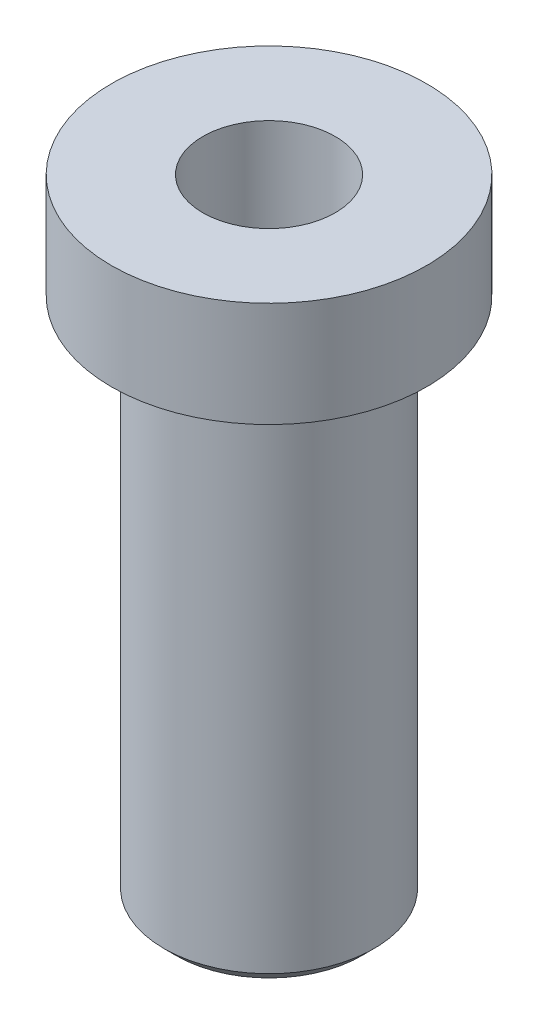
ISO-10303-21;
HEADER;
FILE_DESCRIPTION(('STEP AP214'),'2;1');
FILE_NAME('part.step','',(''),(''),'','','');
FILE_SCHEMA(('AUTOMOTIVE_DESIGN { 1 0 10303 214 1 1 1 1 }'));
ENDSEC;
DATA;
#1=APPLICATION_CONTEXT('core data for automotive mechanical design processes');
#2=APPLICATION_PROTOCOL_DEFINITION('international standard','automotive_design',2000,#1);
#3=PRODUCT_CONTEXT('',#1,'mechanical');
#4=PRODUCT('Part','Part','',(#3));
#5=PRODUCT_RELATED_PRODUCT_CATEGORY('part','',(#4));
#6=PRODUCT_DEFINITION_FORMATION('','',#4);
#7=PRODUCT_DEFINITION_CONTEXT('part definition',#1,'design');
#8=PRODUCT_DEFINITION('design','',#6,#7);
#9=PRODUCT_DEFINITION_SHAPE('','',#8);
#10=(LENGTH_UNIT() NAMED_UNIT(*) SI_UNIT(.MILLI.,.METRE.));
#11=(NAMED_UNIT(*) PLANE_ANGLE_UNIT() SI_UNIT($,.RADIAN.));
#12=(NAMED_UNIT(*) SI_UNIT($,.STERADIAN.) SOLID_ANGLE_UNIT());
#13=UNCERTAINTY_MEASURE_WITH_UNIT(LENGTH_MEASURE(1.E-05),#10,'distance_accuracy_value','');
#14=(GEOMETRIC_REPRESENTATION_CONTEXT(3) GLOBAL_UNCERTAINTY_ASSIGNED_CONTEXT((#13)) GLOBAL_UNIT_ASSIGNED_CONTEXT((#10,
#11,#12)) REPRESENTATION_CONTEXT('',''));
#15=CARTESIAN_POINT('',(0.,0.,0.));
#16=DIRECTION('',(0.,0.,1.));
#17=DIRECTION('',(1.,0.,0.));
#18=AXIS2_PLACEMENT_3D('',#15,#16,#17);
#19=CARTESIAN_POINT('',(0.,3.,0.));
#20=DIRECTION('',(0.,-1.,0.));
#21=DIRECTION('',(0.,0.,-1.));
#22=AXIS2_PLACEMENT_3D('',#19,#20,#21);
#23=CYLINDRICAL_SURFACE('',#22,0.5);
#24=CARTESIAN_POINT('',(0.,0.0600000000000006,0.));
#25=DIRECTION('',(0.,1.,0.));
#26=DIRECTION('',(0.,0.,1.));
#27=AXIS2_PLACEMENT_3D('',#24,#25,#26);
#28=CIRCLE('',#27,0.5);
#29=CARTESIAN_POINT('',(0.,0.0600000000000006,0.5));
#30=VERTEX_POINT('',#29);
#31=EDGE_CURVE('E45',#30,#30,#28,.T.);
#32=ORIENTED_EDGE('',*,*,#31,.T.);
#33=EDGE_LOOP('',(#32));
#34=FACE_BOUND('',#33,.T.);
#35=CARTESIAN_POINT('',(0.,2.5,0.));
#36=DIRECTION('',(0.,1.,0.));
#37=DIRECTION('',(0.,0.,1.));
#38=AXIS2_PLACEMENT_3D('',#35,#36,#37);
#39=CIRCLE('',#38,0.5);
#40=CARTESIAN_POINT('',(0.,2.5,0.5));
#41=VERTEX_POINT('',#40);
#42=EDGE_CURVE('E49',#41,#41,#39,.T.);
#43=ORIENTED_EDGE('',*,*,#42,.F.);
#44=EDGE_LOOP('',(#43));
#45=FACE_BOUND('',#44,.T.);
#46=ADVANCED_FACE('F37',(#34,#45),#23,.T.);
#47=CARTESIAN_POINT('',(0.,0.,0.));
#48=DIRECTION('',(0.,1.,0.));
#49=DIRECTION('',(0.,0.,1.));
#50=AXIS2_PLACEMENT_3D('',#47,#48,#49);
#51=PLANE('',#50);
#52=CARTESIAN_POINT('',(0.,0.,0.));
#53=DIRECTION('',(0.,1.,0.));
#54=DIRECTION('',(0.,0.,1.));
#55=AXIS2_PLACEMENT_3D('',#52,#53,#54);
#56=CIRCLE('',#55,0.315);
#57=CARTESIAN_POINT('',(0.,0.,0.315));
#58=VERTEX_POINT('',#57);
#59=EDGE_CURVE('E59',#58,#58,#56,.T.);
#60=ORIENTED_EDGE('',*,*,#59,.T.);
#61=EDGE_LOOP('',(#60));
#62=FACE_BOUND('',#61,.T.);
#63=CARTESIAN_POINT('',(0.,0.,0.));
#64=DIRECTION('',(0.,1.,0.));
#65=DIRECTION('',(0.,0.,1.));
#66=AXIS2_PLACEMENT_3D('',#63,#64,#65);
#67=CIRCLE('',#66,0.439999999999999);
#68=CARTESIAN_POINT('',(0.,0.,0.439999999999999));
#69=VERTEX_POINT('',#68);
#70=EDGE_CURVE('E10',#69,#69,#67,.F.);
#71=ORIENTED_EDGE('',*,*,#70,.T.);
#72=EDGE_LOOP('',(#71));
#73=FACE_BOUND('',#72,.T.);
#74=ADVANCED_FACE('F68',(#62,#73),#51,.F.);
#75=CARTESIAN_POINT('',(0.,2.5,0.));
#76=DIRECTION('',(0.,1.,0.));
#77=DIRECTION('',(0.,0.,1.));
#78=AXIS2_PLACEMENT_3D('',#75,#76,#77);
#79=CYLINDRICAL_SURFACE('',#78,0.75);
#80=CARTESIAN_POINT('',(0.,2.5,0.));
#81=DIRECTION('',(0.,1.,0.));
#82=DIRECTION('',(0.,0.,1.));
#83=AXIS2_PLACEMENT_3D('',#80,#81,#82);
#84=CIRCLE('',#83,0.75);
#85=CARTESIAN_POINT('',(0.,2.5,0.75));
#86=VERTEX_POINT('',#85);
#87=EDGE_CURVE('E53',#86,#86,#84,.T.);
#88=ORIENTED_EDGE('',*,*,#87,.T.);
#89=EDGE_LOOP('',(#88));
#90=FACE_BOUND('',#89,.T.);
#91=CARTESIAN_POINT('',(0.,3.,0.));
#92=DIRECTION('',(0.,1.,0.));
#93=DIRECTION('',(0.,0.,1.));
#94=AXIS2_PLACEMENT_3D('',#91,#92,#93);
#95=CIRCLE('',#94,0.75);
#96=CARTESIAN_POINT('',(0.,3.,0.75));
#97=VERTEX_POINT('',#96);
#98=EDGE_CURVE('E56',#97,#97,#95,.T.);
#99=ORIENTED_EDGE('',*,*,#98,.F.);
#100=EDGE_LOOP('',(#99));
#101=FACE_BOUND('',#100,.T.);
#102=ADVANCED_FACE('F83',(#90,#101),#79,.T.);
#103=CARTESIAN_POINT('',(0.,2.5,0.));
#104=DIRECTION('',(0.,1.,0.));
#105=DIRECTION('',(0.,0.,1.));
#106=AXIS2_PLACEMENT_3D('',#103,#104,#105);
#107=PLANE('',#106);
#108=ORIENTED_EDGE('',*,*,#42,.T.);
#109=EDGE_LOOP('',(#108));
#110=FACE_BOUND('',#109,.T.);
#111=ORIENTED_EDGE('',*,*,#87,.F.);
#112=EDGE_LOOP('',(#111));
#113=FACE_BOUND('',#112,.T.);
#114=ADVANCED_FACE('F79',(#110,#113),#107,.F.);
#115=CARTESIAN_POINT('',(0.,3.,0.));
#116=DIRECTION('',(0.,1.,0.));
#117=DIRECTION('',(0.,0.,1.));
#118=AXIS2_PLACEMENT_3D('',#115,#116,#117);
#119=PLANE('',#118);
#120=CARTESIAN_POINT('',(0.,3.,0.));
#121=DIRECTION('',(0.,1.,0.));
#122=DIRECTION('',(0.,0.,1.));
#123=AXIS2_PLACEMENT_3D('',#120,#121,#122);
#124=CIRCLE('',#123,0.315);
#125=CARTESIAN_POINT('',(0.,3.,0.315));
#126=VERTEX_POINT('',#125);
#127=EDGE_CURVE('E62',#126,#126,#124,.T.);
#128=ORIENTED_EDGE('',*,*,#127,.F.);
#129=EDGE_LOOP('',(#128));
#130=FACE_BOUND('',#129,.T.);
#131=ORIENTED_EDGE('',*,*,#98,.T.);
#132=EDGE_LOOP('',(#131));
#133=FACE_BOUND('',#132,.T.);
#134=ADVANCED_FACE('F76',(#130,#133),#119,.T.);
#135=CARTESIAN_POINT('',(0.,0.0600000000000006,0.));
#136=DIRECTION('',(0.,1.,0.));
#137=DIRECTION('',(0.,0.,1.));
#138=AXIS2_PLACEMENT_3D('',#135,#136,#137);
#139=CONICAL_SURFACE('',#138,0.5,0.785398163397448);
#140=ORIENTED_EDGE('',*,*,#70,.F.);
#141=EDGE_LOOP('',(#140));
#142=FACE_BOUND('',#141,.T.);
#143=ORIENTED_EDGE('',*,*,#31,.F.);
#144=EDGE_LOOP('',(#143));
#145=FACE_BOUND('',#144,.T.);
#146=ADVANCED_FACE('F40',(#142,#145),#139,.T.);
#147=CARTESIAN_POINT('',(0.,0.,0.));
#148=DIRECTION('',(0.,1.,0.));
#149=DIRECTION('',(0.,0.,1.));
#150=AXIS2_PLACEMENT_3D('',#147,#148,#149);
#151=CYLINDRICAL_SURFACE('',#150,0.315);
#152=ORIENTED_EDGE('',*,*,#59,.F.);
#153=EDGE_LOOP('',(#152));
#154=FACE_BOUND('',#153,.T.);
#155=ORIENTED_EDGE('',*,*,#127,.T.);
#156=EDGE_LOOP('',(#155));
#157=FACE_BOUND('',#156,.T.);
#158=ADVANCED_FACE('F70',(#154,#157),#151,.F.);
#159=CLOSED_SHELL('',(#46,#74,#102,#114,#134,#146,#158));
#160=MANIFOLD_SOLID_BREP('B2',#159);
#161=ADVANCED_BREP_SHAPE_REPRESENTATION('',(#18,#160),#14);
#162=SHAPE_DEFINITION_REPRESENTATION(#9,#161);
ENDSEC;
END-ISO-10303-21;
